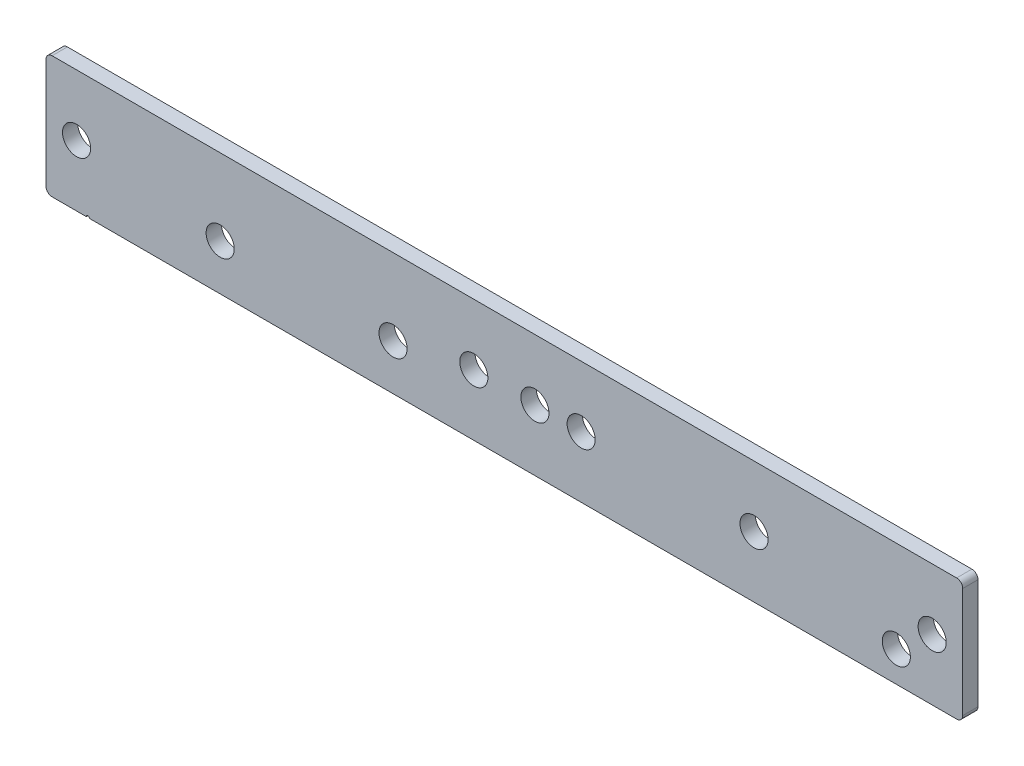
ISO-10303-21;
HEADER;
FILE_DESCRIPTION(('STEP AP214'),'2;1');
FILE_NAME('part.step','',(''),(''),'','','');
FILE_SCHEMA(('AUTOMOTIVE_DESIGN { 1 0 10303 214 1 1 1 1 }'));
ENDSEC;
DATA;
#1=APPLICATION_CONTEXT('core data for automotive mechanical design processes');
#2=APPLICATION_PROTOCOL_DEFINITION('international standard','automotive_design',2000,#1);
#3=PRODUCT_CONTEXT('',#1,'mechanical');
#4=PRODUCT('Part','Part','',(#3));
#5=PRODUCT_RELATED_PRODUCT_CATEGORY('part','',(#4));
#6=PRODUCT_DEFINITION_FORMATION('','',#4);
#7=PRODUCT_DEFINITION_CONTEXT('part definition',#1,'design');
#8=PRODUCT_DEFINITION('design','',#6,#7);
#9=PRODUCT_DEFINITION_SHAPE('','',#8);
#10=(LENGTH_UNIT() NAMED_UNIT(*) SI_UNIT(.MILLI.,.METRE.));
#11=(NAMED_UNIT(*) PLANE_ANGLE_UNIT() SI_UNIT($,.RADIAN.));
#12=(NAMED_UNIT(*) SI_UNIT($,.STERADIAN.) SOLID_ANGLE_UNIT());
#13=UNCERTAINTY_MEASURE_WITH_UNIT(LENGTH_MEASURE(1.E-05),#10,'distance_accuracy_value','');
#14=(GEOMETRIC_REPRESENTATION_CONTEXT(3) GLOBAL_UNCERTAINTY_ASSIGNED_CONTEXT((#13)) GLOBAL_UNIT_ASSIGNED_CONTEXT((#10,
#11,#12)) REPRESENTATION_CONTEXT('',''));
#15=CARTESIAN_POINT('',(0.,0.,0.));
#16=DIRECTION('',(0.,0.,1.));
#17=DIRECTION('',(1.,0.,0.));
#18=AXIS2_PLACEMENT_3D('',#15,#16,#17);
#19=CARTESIAN_POINT('',(-150.,-20.,5.));
#20=DIRECTION('',(0.,1.,0.));
#21=DIRECTION('',(-1.,0.,0.));
#22=AXIS2_PLACEMENT_3D('',#19,#20,#21);
#23=PLANE('',#22);
#24=DIRECTION('',(1.,0.,0.));
#25=VECTOR('',#24,1.);
#26=CARTESIAN_POINT('',(-150.,-20.,0.));
#27=LINE('',#26,#25);
#28=CARTESIAN_POINT('',(-135.784271247347,-20.,0.));
#29=VERTEX_POINT('',#28);
#30=CARTESIAN_POINT('',(148.,-19.9999999999999,0.));
#31=VERTEX_POINT('',#30);
#32=EDGE_CURVE('E133',#29,#31,#27,.T.);
#33=ORIENTED_EDGE('',*,*,#32,.T.);
#34=DIRECTION('',(0.,0.,-1.));
#35=VECTOR('',#34,1.);
#36=CARTESIAN_POINT('',(148.,-19.9999999999999,5.));
#37=LINE('',#36,#35);
#38=CARTESIAN_POINT('',(148.,-19.9999999999999,5.));
#39=VERTEX_POINT('',#38);
#40=EDGE_CURVE('E117',#31,#39,#37,.F.);
#41=ORIENTED_EDGE('',*,*,#40,.T.);
#42=DIRECTION('',(1.,0.,0.));
#43=VECTOR('',#42,1.);
#44=CARTESIAN_POINT('',(-150.,-20.,5.));
#45=LINE('',#44,#43);
#46=CARTESIAN_POINT('',(-135.784271247347,-20.,5.));
#47=VERTEX_POINT('',#46);
#48=EDGE_CURVE('E112',#47,#39,#45,.T.);
#49=ORIENTED_EDGE('',*,*,#48,.F.);
#50=DIRECTION('',(0.,0.,-1.));
#51=VECTOR('',#50,1.);
#52=CARTESIAN_POINT('',(-135.784271247347,-20.,5.));
#53=LINE('',#52,#51);
#54=EDGE_CURVE('E95',#47,#29,#53,.T.);
#55=ORIENTED_EDGE('',*,*,#54,.T.);
#56=EDGE_LOOP('',(#33,#41,#49,#55));
#57=FACE_BOUND('',#56,.T.);
#58=ADVANCED_FACE('F16',(#57),#23,.F.);
#59=CARTESIAN_POINT('',(-150.,20.,5.));
#60=DIRECTION('',(1.,0.,0.));
#61=DIRECTION('',(0.,1.,0.));
#62=AXIS2_PLACEMENT_3D('',#59,#60,#61);
#63=PLANE('',#62);
#64=DIRECTION('',(0.,-1.,0.));
#65=VECTOR('',#64,1.);
#66=CARTESIAN_POINT('',(-150.,20.,0.));
#67=LINE('',#66,#65);
#68=CARTESIAN_POINT('',(-150.,18.,0.));
#69=VERTEX_POINT('',#68);
#70=CARTESIAN_POINT('',(-150.,-18.,0.));
#71=VERTEX_POINT('',#70);
#72=EDGE_CURVE('E131',#69,#71,#67,.T.);
#73=ORIENTED_EDGE('',*,*,#72,.T.);
#74=DIRECTION('',(0.,0.,-1.));
#75=VECTOR('',#74,1.);
#76=CARTESIAN_POINT('',(-150.,-18.,5.));
#77=LINE('',#76,#75);
#78=CARTESIAN_POINT('',(-150.,-18.,5.));
#79=VERTEX_POINT('',#78);
#80=EDGE_CURVE('E10',#71,#79,#77,.F.);
#81=ORIENTED_EDGE('',*,*,#80,.T.);
#82=DIRECTION('',(0.,-1.,0.));
#83=VECTOR('',#82,1.);
#84=CARTESIAN_POINT('',(-150.,20.,5.));
#85=LINE('',#84,#83);
#86=CARTESIAN_POINT('',(-150.,18.,5.));
#87=VERTEX_POINT('',#86);
#88=EDGE_CURVE('E118',#87,#79,#85,.T.);
#89=ORIENTED_EDGE('',*,*,#88,.F.);
#90=DIRECTION('',(0.,0.,-1.));
#91=VECTOR('',#90,1.);
#92=CARTESIAN_POINT('',(-150.,18.,5.));
#93=LINE('',#92,#91);
#94=EDGE_CURVE('E25',#87,#69,#93,.T.);
#95=ORIENTED_EDGE('',*,*,#94,.T.);
#96=EDGE_LOOP('',(#73,#81,#89,#95));
#97=FACE_BOUND('',#96,.T.);
#98=ADVANCED_FACE('F249',(#97),#63,.F.);
#99=CARTESIAN_POINT('',(-148.,-20.,5.));
#100=VERTEX_POINT('',#99);
#101=CARTESIAN_POINT('',(-136.784271247347,-20.,5.));
#102=VERTEX_POINT('',#101);
#103=EDGE_CURVE('E114',#100,#102,#45,.T.);
#104=ORIENTED_EDGE('',*,*,#103,.F.);
#105=DIRECTION('',(0.,0.,-1.));
#106=VECTOR('',#105,1.);
#107=CARTESIAN_POINT('',(-148.,-20.,5.));
#108=LINE('',#107,#106);
#109=CARTESIAN_POINT('',(-148.,-20.,0.));
#110=VERTEX_POINT('',#109);
#111=EDGE_CURVE('E167',#100,#110,#108,.T.);
#112=ORIENTED_EDGE('',*,*,#111,.T.);
#113=CARTESIAN_POINT('',(-136.784271247347,-20.,0.));
#114=VERTEX_POINT('',#113);
#115=EDGE_CURVE('E135',#110,#114,#27,.T.);
#116=ORIENTED_EDGE('',*,*,#115,.T.);
#117=DIRECTION('',(0.,0.,-1.));
#118=VECTOR('',#117,1.);
#119=CARTESIAN_POINT('',(-136.784271247347,-20.,5.));
#120=LINE('',#119,#118);
#121=EDGE_CURVE('E107',#102,#114,#120,.T.);
#122=ORIENTED_EDGE('',*,*,#121,.F.);
#123=EDGE_LOOP('',(#104,#112,#116,#122));
#124=FACE_BOUND('',#123,.T.);
#125=ADVANCED_FACE('F256',(#124),#23,.F.);
#126=CARTESIAN_POINT('',(150.,20.,5.));
#127=DIRECTION('',(-1.,0.,0.));
#128=DIRECTION('',(0.,0.,1.));
#129=AXIS2_PLACEMENT_3D('',#126,#127,#128);
#130=PLANE('',#129);
#131=DIRECTION('',(0.,1.,0.));
#132=VECTOR('',#131,1.);
#133=CARTESIAN_POINT('',(150.,20.,5.));
#134=LINE('',#133,#132);
#135=CARTESIAN_POINT('',(150.,-17.9999999999999,5.));
#136=VERTEX_POINT('',#135);
#137=CARTESIAN_POINT('',(150.,18.,5.));
#138=VERTEX_POINT('',#137);
#139=EDGE_CURVE('E120',#136,#138,#134,.T.);
#140=ORIENTED_EDGE('',*,*,#139,.F.);
#141=DIRECTION('',(0.,0.,-1.));
#142=VECTOR('',#141,1.);
#143=CARTESIAN_POINT('',(150.,-17.9999999999999,5.));
#144=LINE('',#143,#142);
#145=CARTESIAN_POINT('',(150.,-17.9999999999999,0.));
#146=VERTEX_POINT('',#145);
#147=EDGE_CURVE('E143',#136,#146,#144,.T.);
#148=ORIENTED_EDGE('',*,*,#147,.T.);
#149=DIRECTION('',(0.,1.,0.));
#150=VECTOR('',#149,1.);
#151=CARTESIAN_POINT('',(150.,20.,0.));
#152=LINE('',#151,#150);
#153=CARTESIAN_POINT('',(150.,18.,0.));
#154=VERTEX_POINT('',#153);
#155=EDGE_CURVE('E137',#146,#154,#152,.T.);
#156=ORIENTED_EDGE('',*,*,#155,.T.);
#157=DIRECTION('',(0.,0.,-1.));
#158=VECTOR('',#157,1.);
#159=CARTESIAN_POINT('',(150.,18.,5.));
#160=LINE('',#159,#158);
#161=EDGE_CURVE('E130',#154,#138,#160,.F.);
#162=ORIENTED_EDGE('',*,*,#161,.T.);
#163=EDGE_LOOP('',(#140,#148,#156,#162));
#164=FACE_BOUND('',#163,.T.);
#165=ADVANCED_FACE('F236',(#164),#130,.F.);
#166=CARTESIAN_POINT('',(-150.,20.,5.));
#167=DIRECTION('',(0.,-1.,0.));
#168=DIRECTION('',(1.,0.,0.));
#169=AXIS2_PLACEMENT_3D('',#166,#167,#168);
#170=PLANE('',#169);
#171=DIRECTION('',(-1.,0.,0.));
#172=VECTOR('',#171,1.);
#173=CARTESIAN_POINT('',(-150.,20.,5.));
#174=LINE('',#173,#172);
#175=CARTESIAN_POINT('',(148.,20.,5.));
#176=VERTEX_POINT('',#175);
#177=CARTESIAN_POINT('',(-148.,20.,5.));
#178=VERTEX_POINT('',#177);
#179=EDGE_CURVE('E127',#176,#178,#174,.T.);
#180=ORIENTED_EDGE('',*,*,#179,.F.);
#181=DIRECTION('',(0.,0.,-1.));
#182=VECTOR('',#181,1.);
#183=CARTESIAN_POINT('',(148.,20.,5.));
#184=LINE('',#183,#182);
#185=CARTESIAN_POINT('',(148.,20.,0.));
#186=VERTEX_POINT('',#185);
#187=EDGE_CURVE('E164',#176,#186,#184,.T.);
#188=ORIENTED_EDGE('',*,*,#187,.T.);
#189=DIRECTION('',(-1.,0.,0.));
#190=VECTOR('',#189,1.);
#191=CARTESIAN_POINT('',(-150.,20.,0.));
#192=LINE('',#191,#190);
#193=CARTESIAN_POINT('',(-148.,20.,0.));
#194=VERTEX_POINT('',#193);
#195=EDGE_CURVE('E121',#186,#194,#192,.T.);
#196=ORIENTED_EDGE('',*,*,#195,.T.);
#197=DIRECTION('',(0.,0.,-1.));
#198=VECTOR('',#197,1.);
#199=CARTESIAN_POINT('',(-148.,20.,5.));
#200=LINE('',#199,#198);
#201=EDGE_CURVE('E162',#194,#178,#200,.F.);
#202=ORIENTED_EDGE('',*,*,#201,.T.);
#203=EDGE_LOOP('',(#180,#188,#196,#202));
#204=FACE_BOUND('',#203,.T.);
#205=ADVANCED_FACE('F245',(#204),#170,.F.);
#206=CARTESIAN_POINT('',(0.,0.,5.));
#207=DIRECTION('',(0.,0.,1.));
#208=DIRECTION('',(1.,0.,0.));
#209=AXIS2_PLACEMENT_3D('',#206,#207,#208);
#210=PLANE('',#209);
#211=CARTESIAN_POINT('',(-9.99999999999995,0.,5.));
#212=DIRECTION('',(0.,0.,1.));
#213=DIRECTION('',(1.,0.,0.));
#214=AXIS2_PLACEMENT_3D('',#211,#212,#213);
#215=CIRCLE('',#214,4.6);
#216=CARTESIAN_POINT('',(-5.39999999999995,0.,5.));
#217=VERTEX_POINT('',#216);
#218=EDGE_CURVE('E179',#217,#217,#215,.T.);
#219=ORIENTED_EDGE('',*,*,#218,.F.);
#220=EDGE_LOOP('',(#219));
#221=FACE_BOUND('',#220,.T.);
#222=CARTESIAN_POINT('',(10.,0.,5.));
#223=DIRECTION('',(0.,0.,1.));
#224=DIRECTION('',(1.,0.,0.));
#225=AXIS2_PLACEMENT_3D('',#222,#223,#224);
#226=CIRCLE('',#225,4.6);
#227=CARTESIAN_POINT('',(14.6000000000001,0.,5.));
#228=VERTEX_POINT('',#227);
#229=EDGE_CURVE('E325',#228,#228,#226,.T.);
#230=ORIENTED_EDGE('',*,*,#229,.F.);
#231=EDGE_LOOP('',(#230));
#232=FACE_BOUND('',#231,.T.);
#233=CARTESIAN_POINT('',(140.,0.,5.));
#234=DIRECTION('',(0.,0.,1.));
#235=DIRECTION('',(1.,0.,0.));
#236=AXIS2_PLACEMENT_3D('',#233,#234,#235);
#237=CIRCLE('',#236,4.59999999999999);
#238=CARTESIAN_POINT('',(144.6,0.,5.));
#239=VERTEX_POINT('',#238);
#240=EDGE_CURVE('E192',#239,#239,#237,.T.);
#241=ORIENTED_EDGE('',*,*,#240,.F.);
#242=EDGE_LOOP('',(#241));
#243=FACE_BOUND('',#242,.T.);
#244=CARTESIAN_POINT('',(-140.,0.,5.));
#245=DIRECTION('',(0.,0.,1.));
#246=DIRECTION('',(1.,0.,0.));
#247=AXIS2_PLACEMENT_3D('',#244,#245,#246);
#248=CIRCLE('',#247,4.59999999999999);
#249=CARTESIAN_POINT('',(-135.4,0.,5.));
#250=VERTEX_POINT('',#249);
#251=EDGE_CURVE('E175',#250,#250,#248,.T.);
#252=ORIENTED_EDGE('',*,*,#251,.F.);
#253=EDGE_LOOP('',(#252));
#254=FACE_BOUND('',#253,.T.);
#255=ORIENTED_EDGE('',*,*,#48,.T.);
#256=CARTESIAN_POINT('',(148.,-17.9999999999999,5.));
#257=DIRECTION('',(0.,0.,1.));
#258=DIRECTION('',(1.,0.,0.));
#259=AXIS2_PLACEMENT_3D('',#256,#257,#258);
#260=CIRCLE('',#259,2.);
#261=EDGE_CURVE('E160',#39,#136,#260,.T.);
#262=ORIENTED_EDGE('',*,*,#261,.T.);
#263=ORIENTED_EDGE('',*,*,#139,.T.);
#264=CARTESIAN_POINT('',(148.,18.,5.));
#265=DIRECTION('',(0.,0.,1.));
#266=DIRECTION('',(1.,0.,0.));
#267=AXIS2_PLACEMENT_3D('',#264,#265,#266);
#268=CIRCLE('',#267,2.);
#269=EDGE_CURVE('E158',#138,#176,#268,.T.);
#270=ORIENTED_EDGE('',*,*,#269,.T.);
#271=ORIENTED_EDGE('',*,*,#179,.T.);
#272=CARTESIAN_POINT('',(-148.,18.,5.));
#273=DIRECTION('',(0.,0.,1.));
#274=DIRECTION('',(1.,0.,0.));
#275=AXIS2_PLACEMENT_3D('',#272,#273,#274);
#276=CIRCLE('',#275,2.);
#277=EDGE_CURVE('E155',#178,#87,#276,.T.);
#278=ORIENTED_EDGE('',*,*,#277,.T.);
#279=ORIENTED_EDGE('',*,*,#88,.T.);
#280=CARTESIAN_POINT('',(-148.,-18.,5.));
#281=DIRECTION('',(0.,0.,1.));
#282=DIRECTION('',(1.,0.,0.));
#283=AXIS2_PLACEMENT_3D('',#280,#281,#282);
#284=CIRCLE('',#283,2.);
#285=EDGE_CURVE('E33',#79,#100,#284,.T.);
#286=ORIENTED_EDGE('',*,*,#285,.T.);
#287=ORIENTED_EDGE('',*,*,#103,.T.);
#288=CARTESIAN_POINT('',(-136.284271247347,-19.9999999999308,5.));
#289=DIRECTION('',(0.,0.,-1.));
#290=DIRECTION('',(-1.,0.,0.));
#291=AXIS2_PLACEMENT_3D('',#288,#289,#290);
#292=CIRCLE('',#291,0.5);
#293=EDGE_CURVE('E99',#102,#47,#292,.T.);
#294=ORIENTED_EDGE('',*,*,#293,.T.);
#295=EDGE_LOOP('',(#255,#262,#263,#270,#271,#278,#279,#286,#287,#294));
#296=FACE_BOUND('',#295,.T.);
#297=CARTESIAN_POINT('',(-36.4314575050655,-5.00000000000003,5.));
#298=DIRECTION('',(0.,0.,-1.));
#299=DIRECTION('',(-1.,0.,0.));
#300=AXIS2_PLACEMENT_3D('',#297,#298,#299);
#301=CIRCLE('',#300,4.59999999999999);
#302=CARTESIAN_POINT('',(-41.0314575050655,-5.00000000000003,5.));
#303=VERTEX_POINT('',#302);
#304=EDGE_CURVE('E201',#303,#303,#301,.T.);
#305=ORIENTED_EDGE('',*,*,#304,.T.);
#306=EDGE_LOOP('',(#305));
#307=FACE_BOUND('',#306,.T.);
#308=CARTESIAN_POINT('',(128.274169979697,-10.,5.));
#309=DIRECTION('',(0.,0.,-1.));
#310=DIRECTION('',(-1.,0.,0.));
#311=AXIS2_PLACEMENT_3D('',#308,#309,#310);
#312=CIRCLE('',#311,4.6);
#313=CARTESIAN_POINT('',(123.674169979697,-10.,5.));
#314=VERTEX_POINT('',#313);
#315=EDGE_CURVE('E194',#314,#314,#312,.T.);
#316=ORIENTED_EDGE('',*,*,#315,.T.);
#317=EDGE_LOOP('',(#316));
#318=FACE_BOUND('',#317,.T.);
#319=CARTESIAN_POINT('',(-92.9999999999538,-5.00000000000004,5.));
#320=DIRECTION('',(0.,0.,-1.));
#321=DIRECTION('',(-1.,0.,0.));
#322=AXIS2_PLACEMENT_3D('',#319,#320,#321);
#323=CIRCLE('',#322,4.6);
#324=CARTESIAN_POINT('',(-97.5999999999538,-5.00000000000004,5.));
#325=VERTEX_POINT('',#324);
#326=EDGE_CURVE('E216',#325,#325,#323,.T.);
#327=ORIENTED_EDGE('',*,*,#326,.T.);
#328=EDGE_LOOP('',(#327));
#329=FACE_BOUND('',#328,.T.);
#330=CARTESIAN_POINT('',(81.7056274848177,0.,5.));
#331=DIRECTION('',(0.,0.,-1.));
#332=DIRECTION('',(-1.,0.,0.));
#333=AXIS2_PLACEMENT_3D('',#330,#331,#332);
#334=CIRCLE('',#333,4.60000000000001);
#335=CARTESIAN_POINT('',(77.1056274848176,0.,5.));
#336=VERTEX_POINT('',#335);
#337=EDGE_CURVE('E209',#336,#336,#334,.T.);
#338=ORIENTED_EDGE('',*,*,#337,.T.);
#339=EDGE_LOOP('',(#338));
#340=FACE_BOUND('',#339,.T.);
#341=CARTESIAN_POINT('',(25.1370849898937,0.,5.));
#342=DIRECTION('',(0.,0.,-1.));
#343=DIRECTION('',(-1.,0.,0.));
#344=AXIS2_PLACEMENT_3D('',#341,#342,#343);
#345=CIRCLE('',#344,4.6);
#346=CARTESIAN_POINT('',(20.5370849898937,0.,5.));
#347=VERTEX_POINT('',#346);
#348=EDGE_CURVE('E134',#347,#347,#345,.T.);
#349=ORIENTED_EDGE('',*,*,#348,.T.);
#350=EDGE_LOOP('',(#349));
#351=FACE_BOUND('',#350,.T.);
#352=ADVANCED_FACE('F110',(#221,#232,#243,#254,#296,#307,#318,#329,#340,#351),#210,.T.);
#353=CARTESIAN_POINT('',(0.,0.,0.));
#354=DIRECTION('',(0.,0.,1.));
#355=DIRECTION('',(1.,0.,0.));
#356=AXIS2_PLACEMENT_3D('',#353,#354,#355);
#357=PLANE('',#356);
#358=CARTESIAN_POINT('',(-9.99999999999995,0.,0.));
#359=DIRECTION('',(0.,0.,1.));
#360=DIRECTION('',(1.,0.,0.));
#361=AXIS2_PLACEMENT_3D('',#358,#359,#360);
#362=CIRCLE('',#361,4.6);
#363=CARTESIAN_POINT('',(-5.39999999999995,0.,0.));
#364=VERTEX_POINT('',#363);
#365=EDGE_CURVE('E20',#364,#364,#362,.T.);
#366=ORIENTED_EDGE('',*,*,#365,.T.);
#367=EDGE_LOOP('',(#366));
#368=FACE_BOUND('',#367,.T.);
#369=CARTESIAN_POINT('',(10.,0.,0.));
#370=DIRECTION('',(0.,0.,1.));
#371=DIRECTION('',(1.,0.,0.));
#372=AXIS2_PLACEMENT_3D('',#369,#370,#371);
#373=CIRCLE('',#372,4.6);
#374=CARTESIAN_POINT('',(14.6000000000001,0.,0.));
#375=VERTEX_POINT('',#374);
#376=EDGE_CURVE('E178',#375,#375,#373,.T.);
#377=ORIENTED_EDGE('',*,*,#376,.T.);
#378=EDGE_LOOP('',(#377));
#379=FACE_BOUND('',#378,.T.);
#380=CARTESIAN_POINT('',(140.,0.,0.));
#381=DIRECTION('',(0.,0.,1.));
#382=DIRECTION('',(1.,0.,0.));
#383=AXIS2_PLACEMENT_3D('',#380,#381,#382);
#384=CIRCLE('',#383,4.59999999999999);
#385=CARTESIAN_POINT('',(144.6,0.,0.));
#386=VERTEX_POINT('',#385);
#387=EDGE_CURVE('E176',#386,#386,#384,.T.);
#388=ORIENTED_EDGE('',*,*,#387,.T.);
#389=EDGE_LOOP('',(#388));
#390=FACE_BOUND('',#389,.T.);
#391=CARTESIAN_POINT('',(-140.,0.,0.));
#392=DIRECTION('',(0.,0.,1.));
#393=DIRECTION('',(1.,0.,0.));
#394=AXIS2_PLACEMENT_3D('',#391,#392,#393);
#395=CIRCLE('',#394,4.59999999999999);
#396=CARTESIAN_POINT('',(-135.4,0.,0.));
#397=VERTEX_POINT('',#396);
#398=EDGE_CURVE('E172',#397,#397,#395,.T.);
#399=ORIENTED_EDGE('',*,*,#398,.T.);
#400=EDGE_LOOP('',(#399));
#401=FACE_BOUND('',#400,.T.);
#402=CARTESIAN_POINT('',(-36.4314575050655,-5.00000000000003,0.));
#403=DIRECTION('',(0.,0.,-1.));
#404=DIRECTION('',(-1.,0.,0.));
#405=AXIS2_PLACEMENT_3D('',#402,#403,#404);
#406=CIRCLE('',#405,4.59999999999999);
#407=CARTESIAN_POINT('',(-41.0314575050655,-5.00000000000003,0.));
#408=VERTEX_POINT('',#407);
#409=EDGE_CURVE('E204',#408,#408,#406,.T.);
#410=ORIENTED_EDGE('',*,*,#409,.F.);
#411=EDGE_LOOP('',(#410));
#412=FACE_BOUND('',#411,.T.);
#413=CARTESIAN_POINT('',(128.274169979697,-10.,0.));
#414=DIRECTION('',(0.,0.,-1.));
#415=DIRECTION('',(-1.,0.,0.));
#416=AXIS2_PLACEMENT_3D('',#413,#414,#415);
#417=CIRCLE('',#416,4.6);
#418=CARTESIAN_POINT('',(123.674169979697,-10.,0.));
#419=VERTEX_POINT('',#418);
#420=EDGE_CURVE('E198',#419,#419,#417,.T.);
#421=ORIENTED_EDGE('',*,*,#420,.F.);
#422=EDGE_LOOP('',(#421));
#423=FACE_BOUND('',#422,.T.);
#424=CARTESIAN_POINT('',(-92.9999999999538,-5.00000000000004,0.));
#425=DIRECTION('',(0.,0.,-1.));
#426=DIRECTION('',(-1.,0.,0.));
#427=AXIS2_PLACEMENT_3D('',#424,#425,#426);
#428=CIRCLE('',#427,4.6);
#429=CARTESIAN_POINT('',(-97.5999999999538,-5.00000000000004,0.));
#430=VERTEX_POINT('',#429);
#431=EDGE_CURVE('E197',#430,#430,#428,.T.);
#432=ORIENTED_EDGE('',*,*,#431,.F.);
#433=EDGE_LOOP('',(#432));
#434=FACE_BOUND('',#433,.T.);
#435=CARTESIAN_POINT('',(81.7056274848177,0.,0.));
#436=DIRECTION('',(0.,0.,-1.));
#437=DIRECTION('',(-1.,0.,0.));
#438=AXIS2_PLACEMENT_3D('',#435,#436,#437);
#439=CIRCLE('',#438,4.60000000000001);
#440=CARTESIAN_POINT('',(77.1056274848176,0.,0.));
#441=VERTEX_POINT('',#440);
#442=EDGE_CURVE('E213',#441,#441,#439,.T.);
#443=ORIENTED_EDGE('',*,*,#442,.F.);
#444=EDGE_LOOP('',(#443));
#445=FACE_BOUND('',#444,.T.);
#446=CARTESIAN_POINT('',(25.1370849898937,0.,0.));
#447=DIRECTION('',(0.,0.,-1.));
#448=DIRECTION('',(-1.,0.,0.));
#449=AXIS2_PLACEMENT_3D('',#446,#447,#448);
#450=CIRCLE('',#449,4.6);
#451=CARTESIAN_POINT('',(20.5370849898937,0.,0.));
#452=VERTEX_POINT('',#451);
#453=EDGE_CURVE('E212',#452,#452,#450,.T.);
#454=ORIENTED_EDGE('',*,*,#453,.F.);
#455=EDGE_LOOP('',(#454));
#456=FACE_BOUND('',#455,.T.);
#457=ORIENTED_EDGE('',*,*,#155,.F.);
#458=CARTESIAN_POINT('',(148.,-17.9999999999999,0.));
#459=DIRECTION('',(0.,0.,1.));
#460=DIRECTION('',(1.,0.,0.));
#461=AXIS2_PLACEMENT_3D('',#458,#459,#460);
#462=CIRCLE('',#461,2.);
#463=EDGE_CURVE('E152',#146,#31,#462,.F.);
#464=ORIENTED_EDGE('',*,*,#463,.T.);
#465=ORIENTED_EDGE('',*,*,#32,.F.);
#466=CARTESIAN_POINT('',(-136.284271247347,-19.9999999999308,0.));
#467=DIRECTION('',(0.,0.,-1.));
#468=DIRECTION('',(-1.,0.,0.));
#469=AXIS2_PLACEMENT_3D('',#466,#467,#468);
#470=CIRCLE('',#469,0.5);
#471=EDGE_CURVE('E102',#114,#29,#470,.T.);
#472=ORIENTED_EDGE('',*,*,#471,.F.);
#473=ORIENTED_EDGE('',*,*,#115,.F.);
#474=CARTESIAN_POINT('',(-148.,-18.,0.));
#475=DIRECTION('',(0.,0.,1.));
#476=DIRECTION('',(1.,0.,0.));
#477=AXIS2_PLACEMENT_3D('',#474,#475,#476);
#478=CIRCLE('',#477,2.);
#479=EDGE_CURVE('E148',#110,#71,#478,.F.);
#480=ORIENTED_EDGE('',*,*,#479,.T.);
#481=ORIENTED_EDGE('',*,*,#72,.F.);
#482=CARTESIAN_POINT('',(-148.,18.,0.));
#483=DIRECTION('',(0.,0.,1.));
#484=DIRECTION('',(1.,0.,0.));
#485=AXIS2_PLACEMENT_3D('',#482,#483,#484);
#486=CIRCLE('',#485,2.);
#487=EDGE_CURVE('E146',#69,#194,#486,.F.);
#488=ORIENTED_EDGE('',*,*,#487,.T.);
#489=ORIENTED_EDGE('',*,*,#195,.F.);
#490=CARTESIAN_POINT('',(148.,18.,0.));
#491=DIRECTION('',(0.,0.,1.));
#492=DIRECTION('',(1.,0.,0.));
#493=AXIS2_PLACEMENT_3D('',#490,#491,#492);
#494=CIRCLE('',#493,2.);
#495=EDGE_CURVE('E150',#186,#154,#494,.F.);
#496=ORIENTED_EDGE('',*,*,#495,.T.);
#497=EDGE_LOOP('',(#457,#464,#465,#472,#473,#480,#481,#488,#489,#496));
#498=FACE_BOUND('',#497,.T.);
#499=ADVANCED_FACE('F227',(#368,#379,#390,#401,#412,#423,#434,#445,#456,#498),#357,.F.);
#500=CARTESIAN_POINT('',(25.1370849898937,0.,5.));
#501=DIRECTION('',(0.,0.,-1.));
#502=DIRECTION('',(-1.,0.,0.));
#503=AXIS2_PLACEMENT_3D('',#500,#501,#502);
#504=CYLINDRICAL_SURFACE('',#503,4.6);
#505=ORIENTED_EDGE('',*,*,#348,.F.);
#506=EDGE_LOOP('',(#505));
#507=FACE_BOUND('',#506,.T.);
#508=ORIENTED_EDGE('',*,*,#453,.T.);
#509=EDGE_LOOP('',(#508));
#510=FACE_BOUND('',#509,.T.);
#511=ADVANCED_FACE('F225',(#507,#510),#504,.F.);
#512=CARTESIAN_POINT('',(81.7056274848177,0.,5.));
#513=DIRECTION('',(0.,0.,-1.));
#514=DIRECTION('',(-1.,0.,0.));
#515=AXIS2_PLACEMENT_3D('',#512,#513,#514);
#516=CYLINDRICAL_SURFACE('',#515,4.60000000000001);
#517=ORIENTED_EDGE('',*,*,#337,.F.);
#518=EDGE_LOOP('',(#517));
#519=FACE_BOUND('',#518,.T.);
#520=ORIENTED_EDGE('',*,*,#442,.T.);
#521=EDGE_LOOP('',(#520));
#522=FACE_BOUND('',#521,.T.);
#523=ADVANCED_FACE('F290',(#519,#522),#516,.F.);
#524=CARTESIAN_POINT('',(-92.9999999999538,-5.00000000000004,5.));
#525=DIRECTION('',(0.,0.,-1.));
#526=DIRECTION('',(-1.,0.,0.));
#527=AXIS2_PLACEMENT_3D('',#524,#525,#526);
#528=CYLINDRICAL_SURFACE('',#527,4.6);
#529=ORIENTED_EDGE('',*,*,#326,.F.);
#530=EDGE_LOOP('',(#529));
#531=FACE_BOUND('',#530,.T.);
#532=ORIENTED_EDGE('',*,*,#431,.T.);
#533=EDGE_LOOP('',(#532));
#534=FACE_BOUND('',#533,.T.);
#535=ADVANCED_FACE('F292',(#531,#534),#528,.F.);
#536=CARTESIAN_POINT('',(128.274169979697,-10.,5.));
#537=DIRECTION('',(0.,0.,-1.));
#538=DIRECTION('',(-1.,0.,0.));
#539=AXIS2_PLACEMENT_3D('',#536,#537,#538);
#540=CYLINDRICAL_SURFACE('',#539,4.6);
#541=ORIENTED_EDGE('',*,*,#315,.F.);
#542=EDGE_LOOP('',(#541));
#543=FACE_BOUND('',#542,.T.);
#544=ORIENTED_EDGE('',*,*,#420,.T.);
#545=EDGE_LOOP('',(#544));
#546=FACE_BOUND('',#545,.T.);
#547=ADVANCED_FACE('F295',(#543,#546),#540,.F.);
#548=CARTESIAN_POINT('',(-36.4314575050655,-5.00000000000003,5.));
#549=DIRECTION('',(0.,0.,-1.));
#550=DIRECTION('',(-1.,0.,0.));
#551=AXIS2_PLACEMENT_3D('',#548,#549,#550);
#552=CYLINDRICAL_SURFACE('',#551,4.59999999999999);
#553=ORIENTED_EDGE('',*,*,#304,.F.);
#554=EDGE_LOOP('',(#553));
#555=FACE_BOUND('',#554,.T.);
#556=ORIENTED_EDGE('',*,*,#409,.T.);
#557=EDGE_LOOP('',(#556));
#558=FACE_BOUND('',#557,.T.);
#559=ADVANCED_FACE('F267',(#555,#558),#552,.F.);
#560=CARTESIAN_POINT('',(-136.284271247347,-19.9999999999308,5.));
#561=DIRECTION('',(0.,0.,-1.));
#562=DIRECTION('',(-1.,0.,0.));
#563=AXIS2_PLACEMENT_3D('',#560,#561,#562);
#564=CYLINDRICAL_SURFACE('',#563,0.5);
#565=ORIENTED_EDGE('',*,*,#471,.T.);
#566=ORIENTED_EDGE('',*,*,#54,.F.);
#567=ORIENTED_EDGE('',*,*,#293,.F.);
#568=ORIENTED_EDGE('',*,*,#121,.T.);
#569=EDGE_LOOP('',(#565,#566,#567,#568));
#570=FACE_BOUND('',#569,.T.);
#571=ADVANCED_FACE('F97',(#570),#564,.F.);
#572=CARTESIAN_POINT('',(148.,-17.9999999999999,5.));
#573=DIRECTION('',(0.,0.,-1.));
#574=DIRECTION('',(-1.,0.,0.));
#575=AXIS2_PLACEMENT_3D('',#572,#573,#574);
#576=CYLINDRICAL_SURFACE('',#575,2.);
#577=ORIENTED_EDGE('',*,*,#261,.F.);
#578=ORIENTED_EDGE('',*,*,#40,.F.);
#579=ORIENTED_EDGE('',*,*,#463,.F.);
#580=ORIENTED_EDGE('',*,*,#147,.F.);
#581=EDGE_LOOP('',(#577,#578,#579,#580));
#582=FACE_BOUND('',#581,.T.);
#583=ADVANCED_FACE('F258',(#582),#576,.T.);
#584=CARTESIAN_POINT('',(148.,18.,5.));
#585=DIRECTION('',(0.,0.,-1.));
#586=DIRECTION('',(-1.,0.,0.));
#587=AXIS2_PLACEMENT_3D('',#584,#585,#586);
#588=CYLINDRICAL_SURFACE('',#587,2.);
#589=ORIENTED_EDGE('',*,*,#269,.F.);
#590=ORIENTED_EDGE('',*,*,#161,.F.);
#591=ORIENTED_EDGE('',*,*,#495,.F.);
#592=ORIENTED_EDGE('',*,*,#187,.F.);
#593=EDGE_LOOP('',(#589,#590,#591,#592));
#594=FACE_BOUND('',#593,.T.);
#595=ADVANCED_FACE('F240',(#594),#588,.T.);
#596=CARTESIAN_POINT('',(-148.,-18.,5.));
#597=DIRECTION('',(0.,0.,-1.));
#598=DIRECTION('',(-1.,0.,0.));
#599=AXIS2_PLACEMENT_3D('',#596,#597,#598);
#600=CYLINDRICAL_SURFACE('',#599,2.);
#601=ORIENTED_EDGE('',*,*,#285,.F.);
#602=ORIENTED_EDGE('',*,*,#80,.F.);
#603=ORIENTED_EDGE('',*,*,#479,.F.);
#604=ORIENTED_EDGE('',*,*,#111,.F.);
#605=EDGE_LOOP('',(#601,#602,#603,#604));
#606=FACE_BOUND('',#605,.T.);
#607=ADVANCED_FACE('F254',(#606),#600,.T.);
#608=CARTESIAN_POINT('',(-148.,18.,5.));
#609=DIRECTION('',(0.,0.,-1.));
#610=DIRECTION('',(-1.,0.,0.));
#611=AXIS2_PLACEMENT_3D('',#608,#609,#610);
#612=CYLINDRICAL_SURFACE('',#611,2.);
#613=ORIENTED_EDGE('',*,*,#277,.F.);
#614=ORIENTED_EDGE('',*,*,#201,.F.);
#615=ORIENTED_EDGE('',*,*,#487,.F.);
#616=ORIENTED_EDGE('',*,*,#94,.F.);
#617=EDGE_LOOP('',(#613,#614,#615,#616));
#618=FACE_BOUND('',#617,.T.);
#619=ADVANCED_FACE('F18',(#618),#612,.T.);
#620=CARTESIAN_POINT('',(-140.,0.,-5.));
#621=DIRECTION('',(0.,0.,1.));
#622=DIRECTION('',(1.,0.,0.));
#623=AXIS2_PLACEMENT_3D('',#620,#621,#622);
#624=CYLINDRICAL_SURFACE('',#623,4.59999999999999);
#625=ORIENTED_EDGE('',*,*,#251,.T.);
#626=EDGE_LOOP('',(#625));
#627=FACE_BOUND('',#626,.T.);
#628=ORIENTED_EDGE('',*,*,#398,.F.);
#629=EDGE_LOOP('',(#628));
#630=FACE_BOUND('',#629,.T.);
#631=ADVANCED_FACE('F306',(#627,#630),#624,.F.);
#632=CARTESIAN_POINT('',(140.,0.,-5.));
#633=DIRECTION('',(0.,0.,1.));
#634=DIRECTION('',(1.,0.,0.));
#635=AXIS2_PLACEMENT_3D('',#632,#633,#634);
#636=CYLINDRICAL_SURFACE('',#635,4.59999999999999);
#637=ORIENTED_EDGE('',*,*,#240,.T.);
#638=EDGE_LOOP('',(#637));
#639=FACE_BOUND('',#638,.T.);
#640=ORIENTED_EDGE('',*,*,#387,.F.);
#641=EDGE_LOOP('',(#640));
#642=FACE_BOUND('',#641,.T.);
#643=ADVANCED_FACE('F309',(#639,#642),#636,.F.);
#644=CARTESIAN_POINT('',(10.,0.,-5.));
#645=DIRECTION('',(0.,0.,1.));
#646=DIRECTION('',(1.,0.,0.));
#647=AXIS2_PLACEMENT_3D('',#644,#645,#646);
#648=CYLINDRICAL_SURFACE('',#647,4.6);
#649=ORIENTED_EDGE('',*,*,#229,.T.);
#650=EDGE_LOOP('',(#649));
#651=FACE_BOUND('',#650,.T.);
#652=ORIENTED_EDGE('',*,*,#376,.F.);
#653=EDGE_LOOP('',(#652));
#654=FACE_BOUND('',#653,.T.);
#655=ADVANCED_FACE('F312',(#651,#654),#648,.F.);
#656=CARTESIAN_POINT('',(-9.99999999999995,0.,-5.));
#657=DIRECTION('',(0.,0.,1.));
#658=DIRECTION('',(1.,0.,0.));
#659=AXIS2_PLACEMENT_3D('',#656,#657,#658);
#660=CYLINDRICAL_SURFACE('',#659,4.6);
#661=ORIENTED_EDGE('',*,*,#218,.T.);
#662=EDGE_LOOP('',(#661));
#663=FACE_BOUND('',#662,.T.);
#664=ORIENTED_EDGE('',*,*,#365,.F.);
#665=EDGE_LOOP('',(#664));
#666=FACE_BOUND('',#665,.T.);
#667=ADVANCED_FACE('F316',(#663,#666),#660,.F.);
#668=CLOSED_SHELL('',(#58,#98,#125,#165,#205,#352,#499,#511,#523,#535,#547,#559,#571,#583,#595,
#607,#619,#631,#643,#655,#667));
#669=MANIFOLD_SOLID_BREP('B1',#668);
#670=ADVANCED_BREP_SHAPE_REPRESENTATION('',(#18,#669),#14);
#671=SHAPE_DEFINITION_REPRESENTATION(#9,#670);
ENDSEC;
END-ISO-10303-21;
